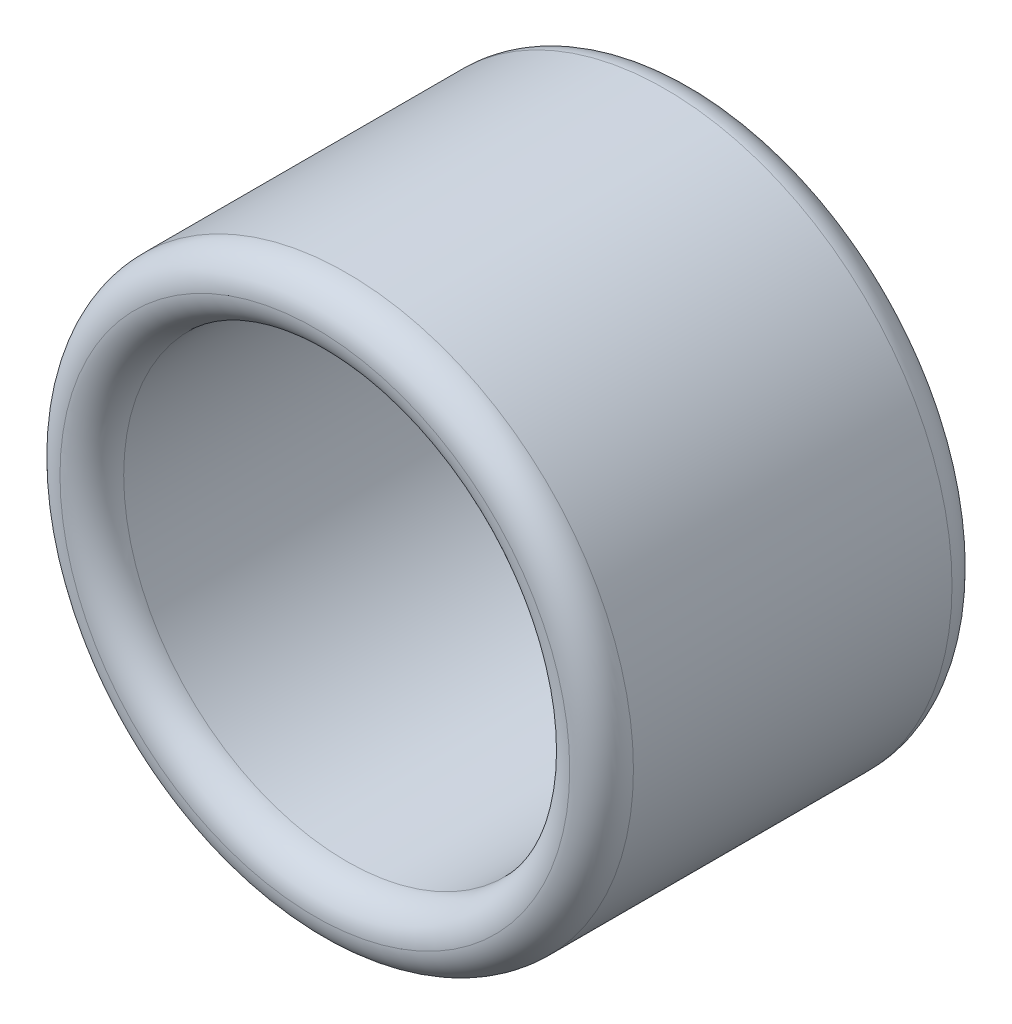
ISO-10303-21;
HEADER;
FILE_DESCRIPTION(('STEP AP214'),'2;1');
FILE_NAME('part.step','',(''),(''),'','','');
FILE_SCHEMA(('AUTOMOTIVE_DESIGN { 1 0 10303 214 1 1 1 1 }'));
ENDSEC;
DATA;
#1=APPLICATION_CONTEXT('core data for automotive mechanical design processes');
#2=APPLICATION_PROTOCOL_DEFINITION('international standard','automotive_design',2000,#1);
#3=PRODUCT_CONTEXT('',#1,'mechanical');
#4=PRODUCT('Part','Part','',(#3));
#5=PRODUCT_RELATED_PRODUCT_CATEGORY('part','',(#4));
#6=PRODUCT_DEFINITION_FORMATION('','',#4);
#7=PRODUCT_DEFINITION_CONTEXT('part definition',#1,'design');
#8=PRODUCT_DEFINITION('design','',#6,#7);
#9=PRODUCT_DEFINITION_SHAPE('','',#8);
#10=(LENGTH_UNIT() NAMED_UNIT(*) SI_UNIT(.MILLI.,.METRE.));
#11=(NAMED_UNIT(*) PLANE_ANGLE_UNIT() SI_UNIT($,.RADIAN.));
#12=(NAMED_UNIT(*) SI_UNIT($,.STERADIAN.) SOLID_ANGLE_UNIT());
#13=UNCERTAINTY_MEASURE_WITH_UNIT(LENGTH_MEASURE(1.E-05),#10,'distance_accuracy_value','');
#14=(GEOMETRIC_REPRESENTATION_CONTEXT(3) GLOBAL_UNCERTAINTY_ASSIGNED_CONTEXT((#13)) GLOBAL_UNIT_ASSIGNED_CONTEXT((#10,
#11,#12)) REPRESENTATION_CONTEXT('',''));
#15=CARTESIAN_POINT('',(0.,0.,0.));
#16=DIRECTION('',(0.,0.,1.));
#17=DIRECTION('',(1.,0.,0.));
#18=AXIS2_PLACEMENT_3D('',#15,#16,#17);
#19=CARTESIAN_POINT('',(-54.9063057062057,0.,6.));
#20=DIRECTION('',(0.,0.,-1.));
#21=DIRECTION('',(-1.,0.,0.));
#22=AXIS2_PLACEMENT_3D('',#19,#20,#21);
#23=CYLINDRICAL_SURFACE('',#22,4.5);
#24=CARTESIAN_POINT('',(-54.9063057062057,0.,0.5));
#25=DIRECTION('',(0.,0.,1.));
#26=DIRECTION('',(1.,0.,0.));
#27=AXIS2_PLACEMENT_3D('',#24,#25,#26);
#28=CIRCLE('',#27,4.5);
#29=CARTESIAN_POINT('',(-50.4063057062057,0.,0.5));
#30=VERTEX_POINT('',#29);
#31=EDGE_CURVE('E10',#30,#30,#28,.T.);
#32=ORIENTED_EDGE('',*,*,#31,.T.);
#33=EDGE_LOOP('',(#32));
#34=FACE_BOUND('',#33,.T.);
#35=CARTESIAN_POINT('',(-54.9063057062057,0.,5.5));
#36=DIRECTION('',(0.,0.,1.));
#37=DIRECTION('',(1.,0.,0.));
#38=AXIS2_PLACEMENT_3D('',#35,#36,#37);
#39=CIRCLE('',#38,4.5);
#40=CARTESIAN_POINT('',(-50.4063057062057,0.,5.5));
#41=VERTEX_POINT('',#40);
#42=EDGE_CURVE('E40',#41,#41,#39,.F.);
#43=ORIENTED_EDGE('',*,*,#42,.T.);
#44=EDGE_LOOP('',(#43));
#45=FACE_BOUND('',#44,.T.);
#46=ADVANCED_FACE('F32',(#34,#45),#23,.T.);
#47=CARTESIAN_POINT('',(-54.9063057062057,0.,6.));
#48=DIRECTION('',(0.,0.,-1.));
#49=DIRECTION('',(-1.,0.,0.));
#50=AXIS2_PLACEMENT_3D('',#47,#48,#49);
#51=CYLINDRICAL_SURFACE('',#50,3.5);
#52=CARTESIAN_POINT('',(-54.9063057062057,0.,0.5));
#53=DIRECTION('',(0.,0.,1.));
#54=DIRECTION('',(1.,0.,0.));
#55=AXIS2_PLACEMENT_3D('',#52,#53,#54);
#56=CIRCLE('',#55,3.5);
#57=CARTESIAN_POINT('',(-51.4063057062057,0.,0.5));
#58=VERTEX_POINT('',#57);
#59=EDGE_CURVE('E45',#58,#58,#56,.F.);
#60=ORIENTED_EDGE('',*,*,#59,.T.);
#61=EDGE_LOOP('',(#60));
#62=FACE_BOUND('',#61,.T.);
#63=CARTESIAN_POINT('',(-54.9063057062057,0.,5.5));
#64=DIRECTION('',(0.,0.,1.));
#65=DIRECTION('',(1.,0.,0.));
#66=AXIS2_PLACEMENT_3D('',#63,#64,#65);
#67=CIRCLE('',#66,3.5);
#68=CARTESIAN_POINT('',(-51.4063057062057,0.,5.5));
#69=VERTEX_POINT('',#68);
#70=EDGE_CURVE('E50',#69,#69,#67,.T.);
#71=ORIENTED_EDGE('',*,*,#70,.T.);
#72=EDGE_LOOP('',(#71));
#73=FACE_BOUND('',#72,.T.);
#74=ADVANCED_FACE('F73',(#62,#73),#51,.F.);
#75=CARTESIAN_POINT('',(-54.9063057062057,0.,0.5));
#76=DIRECTION('',(0.,0.,1.));
#77=DIRECTION('',(1.,0.,0.));
#78=AXIS2_PLACEMENT_3D('',#75,#76,#77);
#79=TOROIDAL_SURFACE('',#78,4.00000000000001,0.5);
#80=ORIENTED_EDGE('',*,*,#31,.F.);
#81=EDGE_LOOP('',(#80));
#82=FACE_BOUND('',#81,.T.);
#83=CARTESIAN_POINT('',(-54.9063057062057,0.,0.));
#84=DIRECTION('',(0.,0.,1.));
#85=DIRECTION('',(1.,0.,0.));
#86=AXIS2_PLACEMENT_3D('',#83,#84,#85);
#87=CIRCLE('',#86,4.00000000000001);
#88=CARTESIAN_POINT('',(-50.9063057062057,0.,0.));
#89=VERTEX_POINT('',#88);
#90=EDGE_CURVE('E48',#89,#89,#87,.F.);
#91=ORIENTED_EDGE('',*,*,#90,.F.);
#92=EDGE_LOOP('',(#91));
#93=FACE_BOUND('',#92,.T.);
#94=ADVANCED_FACE('F68',(#82,#93),#79,.T.);
#95=CARTESIAN_POINT('',(-54.9063057062057,0.,0.5));
#96=DIRECTION('',(0.,0.,1.));
#97=DIRECTION('',(1.,0.,0.));
#98=AXIS2_PLACEMENT_3D('',#95,#96,#97);
#99=TOROIDAL_SURFACE('',#98,4.,0.5);
#100=ORIENTED_EDGE('',*,*,#59,.F.);
#101=EDGE_LOOP('',(#100));
#102=FACE_BOUND('',#101,.T.);
#103=ORIENTED_EDGE('',*,*,#90,.T.);
#104=EDGE_LOOP('',(#103));
#105=FACE_BOUND('',#104,.T.);
#106=ADVANCED_FACE('F62',(#102,#105),#99,.T.);
#107=CARTESIAN_POINT('',(-54.9063057062057,0.,5.5));
#108=DIRECTION('',(0.,0.,1.));
#109=DIRECTION('',(1.,0.,0.));
#110=AXIS2_PLACEMENT_3D('',#107,#108,#109);
#111=TOROIDAL_SURFACE('',#110,4.00000000000001,0.5);
#112=ORIENTED_EDGE('',*,*,#42,.F.);
#113=EDGE_LOOP('',(#112));
#114=FACE_BOUND('',#113,.T.);
#115=CARTESIAN_POINT('',(-54.9063057062057,0.,6.));
#116=DIRECTION('',(0.,0.,1.));
#117=DIRECTION('',(1.,0.,0.));
#118=AXIS2_PLACEMENT_3D('',#115,#116,#117);
#119=CIRCLE('',#118,4.00000000000001);
#120=CARTESIAN_POINT('',(-50.9063057062057,0.,6.));
#121=VERTEX_POINT('',#120);
#122=EDGE_CURVE('E36',#121,#121,#119,.T.);
#123=ORIENTED_EDGE('',*,*,#122,.F.);
#124=EDGE_LOOP('',(#123));
#125=FACE_BOUND('',#124,.T.);
#126=ADVANCED_FACE('F34',(#114,#125),#111,.T.);
#127=CARTESIAN_POINT('',(-54.9063057062057,0.,5.5));
#128=DIRECTION('',(0.,0.,1.));
#129=DIRECTION('',(1.,0.,0.));
#130=AXIS2_PLACEMENT_3D('',#127,#128,#129);
#131=TOROIDAL_SURFACE('',#130,4.,0.5);
#132=ORIENTED_EDGE('',*,*,#122,.T.);
#133=EDGE_LOOP('',(#132));
#134=FACE_BOUND('',#133,.T.);
#135=ORIENTED_EDGE('',*,*,#70,.F.);
#136=EDGE_LOOP('',(#135));
#137=FACE_BOUND('',#136,.T.);
#138=ADVANCED_FACE('F58',(#134,#137),#131,.T.);
#139=CLOSED_SHELL('',(#46,#74,#94,#106,#126,#138));
#140=MANIFOLD_SOLID_BREP('B2',#139);
#141=ADVANCED_BREP_SHAPE_REPRESENTATION('',(#18,#140),#14);
#142=SHAPE_DEFINITION_REPRESENTATION(#9,#141);
ENDSEC;
END-ISO-10303-21;
